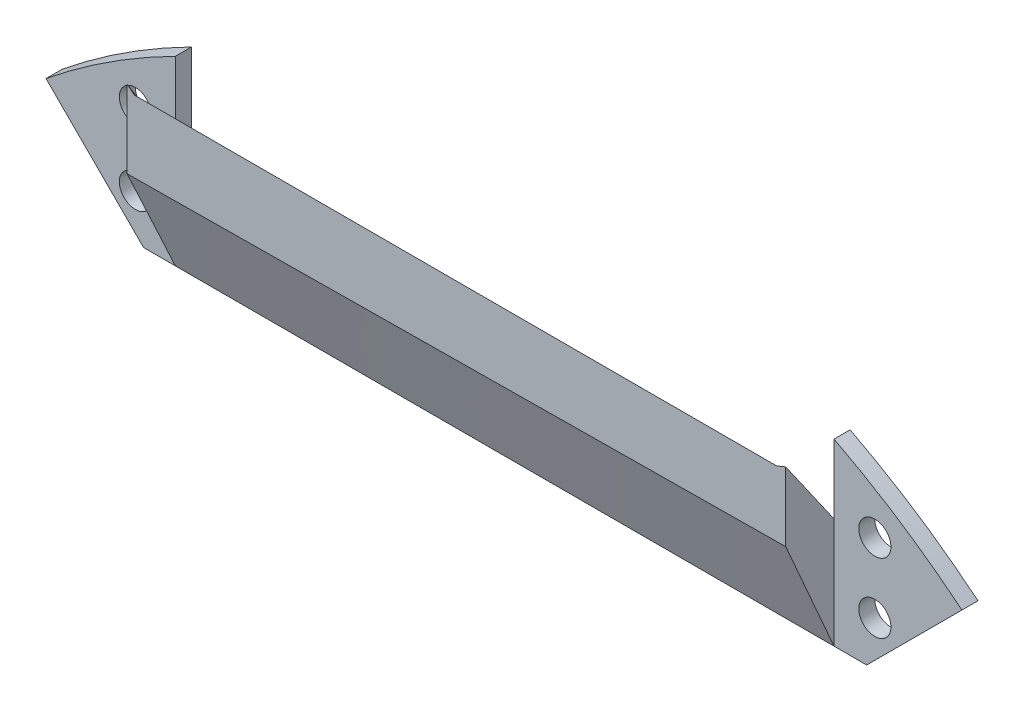
ISO-10303-21;
HEADER;
FILE_DESCRIPTION(('STEP AP214'),'2;1');
FILE_NAME('part.step','',(''),(''),'','','');
FILE_SCHEMA(('AUTOMOTIVE_DESIGN { 1 0 10303 214 1 1 1 1 }'));
ENDSEC;
DATA;
#1=APPLICATION_CONTEXT('core data for automotive mechanical design processes');
#2=APPLICATION_PROTOCOL_DEFINITION('international standard','automotive_design',2000,#1);
#3=PRODUCT_CONTEXT('',#1,'mechanical');
#4=PRODUCT('Part','Part','',(#3));
#5=PRODUCT_RELATED_PRODUCT_CATEGORY('part','',(#4));
#6=PRODUCT_DEFINITION_FORMATION('','',#4);
#7=PRODUCT_DEFINITION_CONTEXT('part definition',#1,'design');
#8=PRODUCT_DEFINITION('design','',#6,#7);
#9=PRODUCT_DEFINITION_SHAPE('','',#8);
#10=(LENGTH_UNIT() NAMED_UNIT(*) SI_UNIT(.MILLI.,.METRE.));
#11=(NAMED_UNIT(*) PLANE_ANGLE_UNIT() SI_UNIT($,.RADIAN.));
#12=(NAMED_UNIT(*) SI_UNIT($,.STERADIAN.) SOLID_ANGLE_UNIT());
#13=UNCERTAINTY_MEASURE_WITH_UNIT(LENGTH_MEASURE(1.E-05),#10,'distance_accuracy_value','');
#14=(GEOMETRIC_REPRESENTATION_CONTEXT(3) GLOBAL_UNCERTAINTY_ASSIGNED_CONTEXT((#13)) GLOBAL_UNIT_ASSIGNED_CONTEXT((#10,
#11,#12)) REPRESENTATION_CONTEXT('',''));
#15=CARTESIAN_POINT('',(0.,0.,0.));
#16=DIRECTION('',(0.,0.,1.));
#17=DIRECTION('',(1.,0.,0.));
#18=AXIS2_PLACEMENT_3D('',#15,#16,#17);
#19=CARTESIAN_POINT('',(312.744782742167,122.63354104966,2.));
#20=DIRECTION('',(0.,0.,1.));
#21=DIRECTION('',(1.,0.,0.));
#22=AXIS2_PLACEMENT_3D('',#19,#20,#21);
#23=PLANE('',#22);
#24=CARTESIAN_POINT('',(359.0430208,185.928,2.));
#25=DIRECTION('',(0.,0.,-1.));
#26=DIRECTION('',(-1.,0.,0.));
#27=AXIS2_PLACEMENT_3D('',#24,#25,#26);
#28=CIRCLE('',#27,1.99999599999999);
#29=CARTESIAN_POINT('',(357.0430248,185.928,2.));
#30=VERTEX_POINT('',#29);
#31=EDGE_CURVE('E354',#30,#30,#28,.T.);
#32=ORIENTED_EDGE('',*,*,#31,.T.);
#33=EDGE_LOOP('',(#32));
#34=FACE_BOUND('',#33,.T.);
#35=CARTESIAN_POINT('',(359.0430208,194.564,2.));
#36=DIRECTION('',(0.,0.,-1.));
#37=DIRECTION('',(-1.,0.,0.));
#38=AXIS2_PLACEMENT_3D('',#35,#36,#37);
#39=CIRCLE('',#38,1.99999599999999);
#40=CARTESIAN_POINT('',(357.0430248,194.564,2.));
#41=VERTEX_POINT('',#40);
#42=EDGE_CURVE('E213',#41,#41,#39,.T.);
#43=ORIENTED_EDGE('',*,*,#42,.T.);
#44=EDGE_LOOP('',(#43));
#45=FACE_BOUND('',#44,.T.);
#46=DIRECTION('',(0.,-1.,0.));
#47=VECTOR('',#46,1.);
#48=CARTESIAN_POINT('',(353.9630208,202.640144059614,2.));
#49=LINE('',#48,#47);
#50=CARTESIAN_POINT('',(353.9630208,202.640144059614,2.));
#51=VERTEX_POINT('',#50);
#52=CARTESIAN_POINT('',(353.9630208,194.056,2.));
#53=VERTEX_POINT('',#52);
#54=EDGE_CURVE('E270',#51,#53,#49,.T.);
#55=ORIENTED_EDGE('',*,*,#54,.T.);
#56=DIRECTION('',(0.,1.,0.));
#57=VECTOR('',#56,1.);
#58=CARTESIAN_POINT('',(353.9630208,180.34,2.));
#59=LINE('',#58,#57);
#60=CARTESIAN_POINT('',(353.9630208,180.34,2.));
#61=VERTEX_POINT('',#60);
#62=EDGE_CURVE('E127',#61,#53,#59,.T.);
#63=ORIENTED_EDGE('',*,*,#62,.F.);
#64=DIRECTION('',(1.,0.,0.));
#65=VECTOR('',#64,1.);
#66=CARTESIAN_POINT('',(268.1110208,180.34,2.));
#67=LINE('',#66,#65);
#68=CARTESIAN_POINT('',(358.0270208,180.34,2.));
#69=VERTEX_POINT('',#68);
#70=EDGE_CURVE('E179',#61,#69,#67,.T.);
#71=ORIENTED_EDGE('',*,*,#70,.T.);
#72=DIRECTION('',(0.707156854137584,0.707056704689402,0.));
#73=VECTOR('',#72,1.);
#74=CARTESIAN_POINT('',(369.869282259893,192.180584327099,2.));
#75=LINE('',#74,#73);
#76=CARTESIAN_POINT('',(369.869282259893,192.180584327099,2.));
#77=VERTEX_POINT('',#76);
#78=EDGE_CURVE('E75',#69,#77,#75,.T.);
#79=ORIENTED_EDGE('',*,*,#78,.T.);
#80=CARTESIAN_POINT('',(312.744782742167,122.63354104966,2.));
#81=DIRECTION('',(0.,0.,1.));
#82=DIRECTION('',(1.,0.,0.));
#83=AXIS2_PLACEMENT_3D('',#80,#81,#82);
#84=CIRCLE('',#83,89.9999981876925);
#85=EDGE_CURVE('E239',#77,#51,#84,.T.);
#86=ORIENTED_EDGE('',*,*,#85,.T.);
#87=EDGE_LOOP('',(#55,#63,#71,#79,#86));
#88=FACE_BOUND('',#87,.T.);
#89=ADVANCED_FACE('F55',(#34,#45,#88),#23,.T.);
#90=CARTESIAN_POINT('',(267.0950208,185.928,2.));
#91=DIRECTION('',(0.,0.,-1.));
#92=DIRECTION('',(-1.,0.,0.));
#93=AXIS2_PLACEMENT_3D('',#90,#91,#92);
#94=CIRCLE('',#93,1.99999599999999);
#95=CARTESIAN_POINT('',(265.0950248,185.928,2.));
#96=VERTEX_POINT('',#95);
#97=EDGE_CURVE('E346',#96,#96,#94,.T.);
#98=ORIENTED_EDGE('',*,*,#97,.T.);
#99=EDGE_LOOP('',(#98));
#100=FACE_BOUND('',#99,.T.);
#101=CARTESIAN_POINT('',(267.0950208,195.072,2.));
#102=DIRECTION('',(0.,0.,-1.));
#103=DIRECTION('',(-1.,0.,0.));
#104=AXIS2_PLACEMENT_3D('',#101,#102,#103);
#105=CIRCLE('',#104,1.99999600000005);
#106=CARTESIAN_POINT('',(265.0950248,195.072,2.));
#107=VERTEX_POINT('',#106);
#108=EDGE_CURVE('E338',#107,#107,#105,.T.);
#109=ORIENTED_EDGE('',*,*,#108,.T.);
#110=EDGE_LOOP('',(#109));
#111=FACE_BOUND('',#110,.T.);
#112=CARTESIAN_POINT('',(268.1110208,180.34,2.));
#113=VERTEX_POINT('',#112);
#114=CARTESIAN_POINT('',(272.0624988,180.34,2.));
#115=VERTEX_POINT('',#114);
#116=EDGE_CURVE('E172',#113,#115,#67,.T.);
#117=ORIENTED_EDGE('',*,*,#116,.T.);
#118=DIRECTION('',(0.,-1.,0.));
#119=VECTOR('',#118,1.);
#120=CARTESIAN_POINT('',(272.0624988,193.261996,2.));
#121=LINE('',#120,#119);
#122=CARTESIAN_POINT('',(272.0624988,193.261996,2.));
#123=VERTEX_POINT('',#122);
#124=EDGE_CURVE('E281',#123,#115,#121,.T.);
#125=ORIENTED_EDGE('',*,*,#124,.F.);
#126=DIRECTION('',(0.,1.,0.));
#127=VECTOR('',#126,1.);
#128=CARTESIAN_POINT('',(272.0624988,193.261996,2.));
#129=LINE('',#128,#127);
#130=CARTESIAN_POINT('',(272.0624988,202.913996,2.));
#131=VERTEX_POINT('',#130);
#132=EDGE_CURVE('E266',#123,#131,#129,.T.);
#133=ORIENTED_EDGE('',*,*,#132,.T.);
#134=CARTESIAN_POINT('',(312.744782742167,122.63354104966,2.));
#135=DIRECTION('',(0.,0.,1.));
#136=DIRECTION('',(1.,0.,0.));
#137=AXIS2_PLACEMENT_3D('',#134,#135,#136);
#138=CIRCLE('',#137,89.9999981876924);
#139=CARTESIAN_POINT('',(255.978033196525,192.472898290453,2.));
#140=VERTEX_POINT('',#139);
#141=EDGE_CURVE('E174',#131,#140,#138,.T.);
#142=ORIENTED_EDGE('',*,*,#141,.T.);
#143=DIRECTION('',(0.70710938375904,-0.707104178604476,0.));
#144=VECTOR('',#143,1.);
#145=CARTESIAN_POINT('',(255.978033196525,192.472898290453,2.));
#146=LINE('',#145,#144);
#147=EDGE_CURVE('E167',#140,#113,#146,.T.);
#148=ORIENTED_EDGE('',*,*,#147,.T.);
#149=EDGE_LOOP('',(#117,#125,#133,#142,#148));
#150=FACE_BOUND('',#149,.T.);
#151=ADVANCED_FACE('F169',(#100,#111,#150),#23,.T.);
#152=CARTESIAN_POINT('',(312.744782742167,122.63354104966,2.));
#153=DIRECTION('',(0.,0.,-1.));
#154=DIRECTION('',(-1.,0.,0.));
#155=AXIS2_PLACEMENT_3D('',#152,#153,#154);
#156=CYLINDRICAL_SURFACE('',#155,89.9999981876925);
#157=CARTESIAN_POINT('',(312.744782742167,122.63354104966,0.));
#158=DIRECTION('',(0.,0.,1.));
#159=DIRECTION('',(1.,0.,0.));
#160=AXIS2_PLACEMENT_3D('',#157,#158,#159);
#161=CIRCLE('',#160,89.9999981876925);
#162=CARTESIAN_POINT('',(369.869282259893,192.180584327099,0.));
#163=VERTEX_POINT('',#162);
#164=CARTESIAN_POINT('',(353.9630208,202.640144059614,0.));
#165=VERTEX_POINT('',#164);
#166=EDGE_CURVE('E208',#163,#165,#161,.T.);
#167=ORIENTED_EDGE('',*,*,#166,.T.);
#168=DIRECTION('',(0.,0.,-1.));
#169=VECTOR('',#168,1.);
#170=CARTESIAN_POINT('',(353.9630208,202.640144059614,2.));
#171=LINE('',#170,#169);
#172=EDGE_CURVE('E12',#51,#165,#171,.T.);
#173=ORIENTED_EDGE('',*,*,#172,.F.);
#174=ORIENTED_EDGE('',*,*,#85,.F.);
#175=DIRECTION('',(0.,0.,-1.));
#176=VECTOR('',#175,1.);
#177=CARTESIAN_POINT('',(369.869282259893,192.180584327099,2.));
#178=LINE('',#177,#176);
#179=EDGE_CURVE('E198',#77,#163,#178,.T.);
#180=ORIENTED_EDGE('',*,*,#179,.T.);
#181=EDGE_LOOP('',(#167,#173,#174,#180));
#182=FACE_BOUND('',#181,.T.);
#183=ADVANCED_FACE('F57',(#182),#156,.T.);
#184=CARTESIAN_POINT('',(353.9630208,202.640144059614,2.));
#185=DIRECTION('',(1.,0.,0.));
#186=DIRECTION('',(0.,1.,0.));
#187=AXIS2_PLACEMENT_3D('',#184,#185,#186);
#188=PLANE('',#187);
#189=DIRECTION('',(0.,-1.,0.));
#190=VECTOR('',#189,1.);
#191=CARTESIAN_POINT('',(353.9630208,202.640144059614,0.));
#192=LINE('',#191,#190);
#193=CARTESIAN_POINT('',(353.9630208,194.056,0.));
#194=VERTEX_POINT('',#193);
#195=EDGE_CURVE('E212',#165,#194,#192,.T.);
#196=ORIENTED_EDGE('',*,*,#195,.T.);
#197=DIRECTION('',(0.,0.,-1.));
#198=VECTOR('',#197,1.);
#199=CARTESIAN_POINT('',(353.9630208,194.056,2.));
#200=LINE('',#199,#198);
#201=EDGE_CURVE('E66',#53,#194,#200,.T.);
#202=ORIENTED_EDGE('',*,*,#201,.F.);
#203=ORIENTED_EDGE('',*,*,#54,.F.);
#204=ORIENTED_EDGE('',*,*,#172,.T.);
#205=EDGE_LOOP('',(#196,#202,#203,#204));
#206=FACE_BOUND('',#205,.T.);
#207=ADVANCED_FACE('F474',(#206),#188,.F.);
#208=CARTESIAN_POINT('',(353.9630208,194.056,2.));
#209=DIRECTION('',(0.799999999999999,-0.600000000000001,0.));
#210=DIRECTION('',(0.600000000000001,0.799999999999999,0.));
#211=AXIS2_PLACEMENT_3D('',#208,#209,#210);
#212=PLANE('',#211);
#213=DIRECTION('',(-0.600000000000001,-0.799999999999999,0.));
#214=VECTOR('',#213,1.);
#215=CARTESIAN_POINT('',(353.9630208,194.056,0.));
#216=LINE('',#215,#214);
#217=CARTESIAN_POINT('',(347.8670208,185.928,0.));
#218=VERTEX_POINT('',#217);
#219=EDGE_CURVE('E216',#194,#218,#216,.T.);
#220=ORIENTED_EDGE('',*,*,#219,.T.);
#221=DIRECTION('',(0.,0.,-1.));
#222=VECTOR('',#221,1.);
#223=CARTESIAN_POINT('',(347.8670208,185.928,2.));
#224=LINE('',#223,#222);
#225=CARTESIAN_POINT('',(347.8670208,185.928,2.00000000000001));
#226=VERTEX_POINT('',#225);
#227=EDGE_CURVE('E263',#226,#218,#224,.T.);
#228=ORIENTED_EDGE('',*,*,#227,.F.);
#229=DIRECTION('',(0.600000000000001,0.799999999999999,0.));
#230=VECTOR('',#229,1.);
#231=CARTESIAN_POINT('',(353.9630208,194.056,2.));
#232=LINE('',#231,#230);
#233=EDGE_CURVE('E274',#53,#226,#232,.F.);
#234=ORIENTED_EDGE('',*,*,#233,.F.);
#235=ORIENTED_EDGE('',*,*,#201,.T.);
#236=EDGE_LOOP('',(#220,#228,#234,#235));
#237=FACE_BOUND('',#236,.T.);
#238=ADVANCED_FACE('F478',(#237),#212,.F.);
#239=CARTESIAN_POINT('',(347.8670208,185.928,2.));
#240=DIRECTION('',(0.,-1.,0.));
#241=DIRECTION('',(0.,0.,-1.));
#242=AXIS2_PLACEMENT_3D('',#239,#240,#241);
#243=PLANE('',#242);
#244=DIRECTION('',(-1.,0.,0.));
#245=VECTOR('',#244,1.);
#246=CARTESIAN_POINT('',(347.8670208,185.928,0.));
#247=LINE('',#246,#245);
#248=CARTESIAN_POINT('',(277.7630208,185.928,0.));
#249=VERTEX_POINT('',#248);
#250=EDGE_CURVE('E219',#218,#249,#247,.T.);
#251=ORIENTED_EDGE('',*,*,#250,.T.);
#252=DIRECTION('',(0.,0.,-1.));
#253=VECTOR('',#252,1.);
#254=CARTESIAN_POINT('',(277.7630208,185.928,2.));
#255=LINE('',#254,#253);
#256=CARTESIAN_POINT('',(277.7630208,185.928,2.00000000000001));
#257=VERTEX_POINT('',#256);
#258=EDGE_CURVE('E256',#257,#249,#255,.T.);
#259=ORIENTED_EDGE('',*,*,#258,.F.);
#260=DIRECTION('',(1.,0.,0.));
#261=VECTOR('',#260,1.);
#262=CARTESIAN_POINT('',(0.,185.928,2.00000000000003));
#263=LINE('',#262,#261);
#264=EDGE_CURVE('E291',#226,#257,#263,.F.);
#265=ORIENTED_EDGE('',*,*,#264,.F.);
#266=ORIENTED_EDGE('',*,*,#227,.T.);
#267=EDGE_LOOP('',(#251,#259,#265,#266));
#268=FACE_BOUND('',#267,.T.);
#269=ADVANCED_FACE('F565',(#268),#243,.F.);
#270=CARTESIAN_POINT('',(277.7630208,185.928,2.));
#271=DIRECTION('',(-0.789545062308471,-0.613692589644288,0.));
#272=DIRECTION('',(0.613692589644288,-0.789545062308471,0.));
#273=AXIS2_PLACEMENT_3D('',#270,#271,#272);
#274=PLANE('',#273);
#275=DIRECTION('',(-0.613692589644288,0.789545062308471,0.));
#276=VECTOR('',#275,1.);
#277=CARTESIAN_POINT('',(277.7630208,185.928,0.));
#278=LINE('',#277,#276);
#279=CARTESIAN_POINT('',(272.0624988,193.261996,0.));
#280=VERTEX_POINT('',#279);
#281=EDGE_CURVE('E222',#249,#280,#278,.T.);
#282=ORIENTED_EDGE('',*,*,#281,.T.);
#283=DIRECTION('',(0.,0.,-1.));
#284=VECTOR('',#283,1.);
#285=CARTESIAN_POINT('',(272.0624988,193.261996,2.));
#286=LINE('',#285,#284);
#287=EDGE_CURVE('E250',#123,#280,#286,.T.);
#288=ORIENTED_EDGE('',*,*,#287,.F.);
#289=DIRECTION('',(0.613692589644288,-0.789545062308471,0.));
#290=VECTOR('',#289,1.);
#291=CARTESIAN_POINT('',(277.7630208,185.928,2.));
#292=LINE('',#291,#290);
#293=EDGE_CURVE('E269',#257,#123,#292,.F.);
#294=ORIENTED_EDGE('',*,*,#293,.F.);
#295=ORIENTED_EDGE('',*,*,#258,.T.);
#296=EDGE_LOOP('',(#282,#288,#294,#295));
#297=FACE_BOUND('',#296,.T.);
#298=ADVANCED_FACE('F457',(#297),#274,.F.);
#299=CARTESIAN_POINT('',(272.0624988,193.261996,2.));
#300=DIRECTION('',(-1.,0.,0.));
#301=DIRECTION('',(0.,0.,1.));
#302=AXIS2_PLACEMENT_3D('',#299,#300,#301);
#303=PLANE('',#302);
#304=DIRECTION('',(0.,1.,0.));
#305=VECTOR('',#304,1.);
#306=CARTESIAN_POINT('',(272.0624988,193.261996,0.));
#307=LINE('',#306,#305);
#308=CARTESIAN_POINT('',(272.0624988,202.913996,0.));
#309=VERTEX_POINT('',#308);
#310=EDGE_CURVE('E225',#280,#309,#307,.T.);
#311=ORIENTED_EDGE('',*,*,#310,.T.);
#312=DIRECTION('',(0.,0.,-1.));
#313=VECTOR('',#312,1.);
#314=CARTESIAN_POINT('',(272.0624988,202.913996,2.));
#315=LINE('',#314,#313);
#316=EDGE_CURVE('E247',#131,#309,#315,.T.);
#317=ORIENTED_EDGE('',*,*,#316,.F.);
#318=ORIENTED_EDGE('',*,*,#132,.F.);
#319=ORIENTED_EDGE('',*,*,#287,.T.);
#320=EDGE_LOOP('',(#311,#317,#318,#319));
#321=FACE_BOUND('',#320,.T.);
#322=ADVANCED_FACE('F459',(#321),#303,.F.);
#323=CARTESIAN_POINT('',(312.744782742167,122.63354104966,2.));
#324=DIRECTION('',(0.,0.,-1.));
#325=DIRECTION('',(-1.,0.,0.));
#326=AXIS2_PLACEMENT_3D('',#323,#324,#325);
#327=CYLINDRICAL_SURFACE('',#326,89.9999981876924);
#328=CARTESIAN_POINT('',(312.744782742167,122.63354104966,0.));
#329=DIRECTION('',(0.,0.,1.));
#330=DIRECTION('',(1.,0.,0.));
#331=AXIS2_PLACEMENT_3D('',#328,#329,#330);
#332=CIRCLE('',#331,89.9999981876924);
#333=CARTESIAN_POINT('',(255.978033196525,192.472898290453,0.));
#334=VERTEX_POINT('',#333);
#335=EDGE_CURVE('E228',#309,#334,#332,.T.);
#336=ORIENTED_EDGE('',*,*,#335,.T.);
#337=DIRECTION('',(0.,0.,-1.));
#338=VECTOR('',#337,1.);
#339=CARTESIAN_POINT('',(255.978033196525,192.472898290453,2.));
#340=LINE('',#339,#338);
#341=EDGE_CURVE('E189',#140,#334,#340,.T.);
#342=ORIENTED_EDGE('',*,*,#341,.F.);
#343=ORIENTED_EDGE('',*,*,#141,.F.);
#344=ORIENTED_EDGE('',*,*,#316,.T.);
#345=EDGE_LOOP('',(#336,#342,#343,#344));
#346=FACE_BOUND('',#345,.T.);
#347=ADVANCED_FACE('F460',(#346),#327,.T.);
#348=CARTESIAN_POINT('',(255.978033196525,192.472898290453,2.));
#349=DIRECTION('',(0.707104178604476,0.70710938375904,0.));
#350=DIRECTION('',(-0.70710938375904,0.707104178604476,0.));
#351=AXIS2_PLACEMENT_3D('',#348,#349,#350);
#352=PLANE('',#351);
#353=DIRECTION('',(0.70710938375904,-0.707104178604476,0.));
#354=VECTOR('',#353,1.);
#355=CARTESIAN_POINT('',(255.978033196525,192.472898290453,0.));
#356=LINE('',#355,#354);
#357=CARTESIAN_POINT('',(268.1110208,180.34,0.));
#358=VERTEX_POINT('',#357);
#359=EDGE_CURVE('E185',#334,#358,#356,.T.);
#360=ORIENTED_EDGE('',*,*,#359,.T.);
#361=DIRECTION('',(0.,0.,-1.));
#362=VECTOR('',#361,1.);
#363=CARTESIAN_POINT('',(268.1110208,180.34,2.));
#364=LINE('',#363,#362);
#365=EDGE_CURVE('E182',#113,#358,#364,.T.);
#366=ORIENTED_EDGE('',*,*,#365,.F.);
#367=ORIENTED_EDGE('',*,*,#147,.F.);
#368=ORIENTED_EDGE('',*,*,#341,.T.);
#369=EDGE_LOOP('',(#360,#366,#367,#368));
#370=FACE_BOUND('',#369,.T.);
#371=ADVANCED_FACE('F183',(#370),#352,.F.);
#372=CARTESIAN_POINT('',(268.1110208,180.34,2.));
#373=DIRECTION('',(0.,1.,0.));
#374=DIRECTION('',(0.,0.,1.));
#375=AXIS2_PLACEMENT_3D('',#372,#373,#374);
#376=PLANE('',#375);
#377=DIRECTION('',(1.,0.,0.));
#378=VECTOR('',#377,1.);
#379=CARTESIAN_POINT('',(268.1110208,180.34,0.));
#380=LINE('',#379,#378);
#381=CARTESIAN_POINT('',(358.0270208,180.34,0.));
#382=VERTEX_POINT('',#381);
#383=EDGE_CURVE('E233',#358,#382,#380,.T.);
#384=ORIENTED_EDGE('',*,*,#383,.T.);
#385=DIRECTION('',(0.,0.,-1.));
#386=VECTOR('',#385,1.);
#387=CARTESIAN_POINT('',(358.0270208,180.34,2.));
#388=LINE('',#387,#386);
#389=EDGE_CURVE('E190',#69,#382,#388,.T.);
#390=ORIENTED_EDGE('',*,*,#389,.F.);
#391=ORIENTED_EDGE('',*,*,#70,.F.);
#392=DIRECTION('',(1.,0.,0.));
#393=VECTOR('',#392,1.);
#394=CARTESIAN_POINT('',(272.0624988,180.34,2.));
#395=LINE('',#394,#393);
#396=EDGE_CURVE('E137',#115,#61,#395,.T.);
#397=ORIENTED_EDGE('',*,*,#396,.F.);
#398=ORIENTED_EDGE('',*,*,#116,.F.);
#399=ORIENTED_EDGE('',*,*,#365,.T.);
#400=EDGE_LOOP('',(#384,#390,#391,#397,#398,#399));
#401=FACE_BOUND('',#400,.T.);
#402=ADVANCED_FACE('F192',(#401),#376,.F.);
#403=CARTESIAN_POINT('',(369.869282259893,192.180584327099,2.));
#404=DIRECTION('',(-0.707056704689402,0.707156854137584,0.));
#405=DIRECTION('',(-0.707156854137584,-0.707056704689402,0.));
#406=AXIS2_PLACEMENT_3D('',#403,#404,#405);
#407=PLANE('',#406);
#408=DIRECTION('',(0.707156854137584,0.707056704689402,0.));
#409=VECTOR('',#408,1.);
#410=CARTESIAN_POINT('',(369.869282259893,192.180584327099,0.));
#411=LINE('',#410,#409);
#412=EDGE_CURVE('E236',#382,#163,#411,.T.);
#413=ORIENTED_EDGE('',*,*,#412,.T.);
#414=ORIENTED_EDGE('',*,*,#179,.F.);
#415=ORIENTED_EDGE('',*,*,#78,.F.);
#416=ORIENTED_EDGE('',*,*,#389,.T.);
#417=EDGE_LOOP('',(#413,#414,#415,#416));
#418=FACE_BOUND('',#417,.T.);
#419=ADVANCED_FACE('F467',(#418),#407,.F.);
#420=CARTESIAN_POINT('',(312.744782742167,122.63354104966,0.));
#421=DIRECTION('',(0.,0.,1.));
#422=DIRECTION('',(1.,0.,0.));
#423=AXIS2_PLACEMENT_3D('',#420,#421,#422);
#424=PLANE('',#423);
#425=CARTESIAN_POINT('',(267.0950208,195.072,0.));
#426=DIRECTION('',(0.,0.,-1.));
#427=DIRECTION('',(-1.,0.,0.));
#428=AXIS2_PLACEMENT_3D('',#425,#426,#427);
#429=CIRCLE('',#428,1.99999600000005);
#430=CARTESIAN_POINT('',(265.0950248,195.072,0.));
#431=VERTEX_POINT('',#430);
#432=EDGE_CURVE('E342',#431,#431,#429,.T.);
#433=ORIENTED_EDGE('',*,*,#432,.F.);
#434=EDGE_LOOP('',(#433));
#435=FACE_BOUND('',#434,.T.);
#436=CARTESIAN_POINT('',(267.0950208,185.928,0.));
#437=DIRECTION('',(0.,0.,-1.));
#438=DIRECTION('',(-1.,0.,0.));
#439=AXIS2_PLACEMENT_3D('',#436,#437,#438);
#440=CIRCLE('',#439,1.99999599999999);
#441=CARTESIAN_POINT('',(265.0950248,185.928,0.));
#442=VERTEX_POINT('',#441);
#443=EDGE_CURVE('E350',#442,#442,#440,.T.);
#444=ORIENTED_EDGE('',*,*,#443,.F.);
#445=EDGE_LOOP('',(#444));
#446=FACE_BOUND('',#445,.T.);
#447=CARTESIAN_POINT('',(359.0430208,185.928,0.));
#448=DIRECTION('',(0.,0.,-1.));
#449=DIRECTION('',(-1.,0.,0.));
#450=AXIS2_PLACEMENT_3D('',#447,#448,#449);
#451=CIRCLE('',#450,1.99999599999999);
#452=CARTESIAN_POINT('',(357.0430248,185.928,0.));
#453=VERTEX_POINT('',#452);
#454=EDGE_CURVE('E358',#453,#453,#451,.T.);
#455=ORIENTED_EDGE('',*,*,#454,.F.);
#456=EDGE_LOOP('',(#455));
#457=FACE_BOUND('',#456,.T.);
#458=CARTESIAN_POINT('',(359.0430208,194.564,0.));
#459=DIRECTION('',(0.,0.,-1.));
#460=DIRECTION('',(-1.,0.,0.));
#461=AXIS2_PLACEMENT_3D('',#458,#459,#460);
#462=CIRCLE('',#461,1.99999599999999);
#463=CARTESIAN_POINT('',(357.0430248,194.564,0.));
#464=VERTEX_POINT('',#463);
#465=EDGE_CURVE('E362',#464,#464,#462,.T.);
#466=ORIENTED_EDGE('',*,*,#465,.F.);
#467=EDGE_LOOP('',(#466));
#468=FACE_BOUND('',#467,.T.);
#469=ORIENTED_EDGE('',*,*,#166,.F.);
#470=ORIENTED_EDGE('',*,*,#412,.F.);
#471=ORIENTED_EDGE('',*,*,#383,.F.);
#472=ORIENTED_EDGE('',*,*,#359,.F.);
#473=ORIENTED_EDGE('',*,*,#335,.F.);
#474=ORIENTED_EDGE('',*,*,#310,.F.);
#475=ORIENTED_EDGE('',*,*,#281,.F.);
#476=ORIENTED_EDGE('',*,*,#250,.F.);
#477=ORIENTED_EDGE('',*,*,#219,.F.);
#478=ORIENTED_EDGE('',*,*,#195,.F.);
#479=EDGE_LOOP('',(#469,#470,#471,#472,#473,#474,#475,#476,#477,#478));
#480=FACE_BOUND('',#479,.T.);
#481=ADVANCED_FACE('F463',(#435,#446,#457,#468,#480),#424,.F.);
#482=CARTESIAN_POINT('',(359.0430208,194.564,2.));
#483=DIRECTION('',(0.,0.,-1.));
#484=DIRECTION('',(-1.,0.,0.));
#485=AXIS2_PLACEMENT_3D('',#482,#483,#484);
#486=CYLINDRICAL_SURFACE('',#485,1.99999599999999);
#487=ORIENTED_EDGE('',*,*,#42,.F.);
#488=EDGE_LOOP('',(#487));
#489=FACE_BOUND('',#488,.T.);
#490=ORIENTED_EDGE('',*,*,#465,.T.);
#491=EDGE_LOOP('',(#490));
#492=FACE_BOUND('',#491,.T.);
#493=ADVANCED_FACE('F548',(#489,#492),#486,.F.);
#494=CARTESIAN_POINT('',(359.0430208,185.928,2.));
#495=DIRECTION('',(0.,0.,-1.));
#496=DIRECTION('',(-1.,0.,0.));
#497=AXIS2_PLACEMENT_3D('',#494,#495,#496);
#498=CYLINDRICAL_SURFACE('',#497,1.99999599999999);
#499=ORIENTED_EDGE('',*,*,#31,.F.);
#500=EDGE_LOOP('',(#499));
#501=FACE_BOUND('',#500,.T.);
#502=ORIENTED_EDGE('',*,*,#454,.T.);
#503=EDGE_LOOP('',(#502));
#504=FACE_BOUND('',#503,.T.);
#505=ADVANCED_FACE('F395',(#501,#504),#498,.F.);
#506=CARTESIAN_POINT('',(267.0950208,185.928,2.));
#507=DIRECTION('',(0.,0.,-1.));
#508=DIRECTION('',(-1.,0.,0.));
#509=AXIS2_PLACEMENT_3D('',#506,#507,#508);
#510=CYLINDRICAL_SURFACE('',#509,1.99999599999999);
#511=ORIENTED_EDGE('',*,*,#97,.F.);
#512=EDGE_LOOP('',(#511));
#513=FACE_BOUND('',#512,.T.);
#514=ORIENTED_EDGE('',*,*,#443,.T.);
#515=EDGE_LOOP('',(#514));
#516=FACE_BOUND('',#515,.T.);
#517=ADVANCED_FACE('F700',(#513,#516),#510,.F.);
#518=CARTESIAN_POINT('',(267.0950208,195.072,2.));
#519=DIRECTION('',(0.,0.,-1.));
#520=DIRECTION('',(-1.,0.,0.));
#521=AXIS2_PLACEMENT_3D('',#518,#519,#520);
#522=CYLINDRICAL_SURFACE('',#521,1.99999600000005);
#523=ORIENTED_EDGE('',*,*,#108,.F.);
#524=EDGE_LOOP('',(#523));
#525=FACE_BOUND('',#524,.T.);
#526=ORIENTED_EDGE('',*,*,#432,.T.);
#527=EDGE_LOOP('',(#526));
#528=FACE_BOUND('',#527,.T.);
#529=ADVANCED_FACE('F388',(#525,#528),#522,.F.);
#530=CARTESIAN_POINT('',(0.,0.,8.));
#531=DIRECTION('',(0.,0.,1.));
#532=DIRECTION('',(1.,0.,0.));
#533=AXIS2_PLACEMENT_3D('',#530,#531,#532);
#534=PLANE('',#533);
#535=DIRECTION('',(-0.778918093395881,0.627125668252007,0.));
#536=VECTOR('',#535,1.);
#537=CARTESIAN_POINT('',(272.0624988,202.913996,8.));
#538=LINE('',#537,#536);
#539=CARTESIAN_POINT('',(272.968388734981,202.184642251956,8.));
#540=VERTEX_POINT('',#539);
#541=CARTESIAN_POINT('',(272.0624988,202.913996,8.));
#542=VERTEX_POINT('',#541);
#543=EDGE_CURVE('E319',#540,#542,#538,.T.);
#544=ORIENTED_EDGE('',*,*,#543,.T.);
#545=DIRECTION('',(0.,-1.,0.));
#546=VECTOR('',#545,1.);
#547=CARTESIAN_POINT('',(272.0624988,202.913996,8.));
#548=LINE('',#547,#546);
#549=CARTESIAN_POINT('',(272.0624988,193.261996,8.));
#550=VERTEX_POINT('',#549);
#551=EDGE_CURVE('E335',#542,#550,#548,.T.);
#552=ORIENTED_EDGE('',*,*,#551,.T.);
#553=DIRECTION('',(0.99995300935212,0.00969428118220794,0.));
#554=VECTOR('',#553,1.);
#555=CARTESIAN_POINT('',(272.0624988,193.261996,8.));
#556=LINE('',#555,#554);
#557=CARTESIAN_POINT('',(353.9630208,194.056,8.));
#558=VERTEX_POINT('',#557);
#559=EDGE_CURVE('E332',#550,#558,#556,.T.);
#560=ORIENTED_EDGE('',*,*,#559,.T.);
#561=DIRECTION('',(0.,1.,0.));
#562=VECTOR('',#561,1.);
#563=CARTESIAN_POINT('',(353.9630208,194.056,8.));
#564=LINE('',#563,#562);
#565=CARTESIAN_POINT('',(353.9630208,202.640144059614,8.));
#566=VERTEX_POINT('',#565);
#567=EDGE_CURVE('E329',#558,#566,#564,.T.);
#568=ORIENTED_EDGE('',*,*,#567,.T.);
#569=DIRECTION('',(-0.93022884271668,-0.36697997244807,0.));
#570=VECTOR('',#569,1.);
#571=CARTESIAN_POINT('',(352.808404877592,202.184642251956,8.));
#572=LINE('',#571,#570);
#573=CARTESIAN_POINT('',(352.808404877592,202.184642251956,8.));
#574=VERTEX_POINT('',#573);
#575=EDGE_CURVE('E326',#566,#574,#572,.T.);
#576=ORIENTED_EDGE('',*,*,#575,.T.);
#577=DIRECTION('',(-1.,0.,0.));
#578=VECTOR('',#577,1.);
#579=CARTESIAN_POINT('',(272.968388734981,202.184642251956,8.));
#580=LINE('',#579,#578);
#581=EDGE_CURVE('E323',#574,#540,#580,.T.);
#582=ORIENTED_EDGE('',*,*,#581,.T.);
#583=EDGE_LOOP('',(#544,#552,#560,#568,#576,#582));
#584=FACE_BOUND('',#583,.T.);
#585=ADVANCED_FACE('F377',(#584),#534,.T.);
#586=CARTESIAN_POINT('',(277.7630208,185.928,2.));
#587=CARTESIAN_POINT('',(272.968388734981,202.184642251956,8.));
#588=CARTESIAN_POINT('',(276.8129338,187.150332666667,2.));
#589=CARTESIAN_POINT('',(272.81740707915,202.306201209963,8.));
#590=CARTESIAN_POINT('',(275.8628468,188.372665333333,2.));
#591=CARTESIAN_POINT('',(272.66642542332,202.427760167971,8.));
#592=CARTESIAN_POINT('',(273.9626728,190.817330666667,2.));
#593=CARTESIAN_POINT('',(272.36446211166,202.670878083985,8.));
#594=CARTESIAN_POINT('',(273.0125858,192.039663333333,2.));
#595=CARTESIAN_POINT('',(272.21348045583,202.792437041993,8.));
#596=CARTESIAN_POINT('',(272.0624988,193.261996,2.));
#597=CARTESIAN_POINT('',(272.0624988,202.913996,8.));
#598=B_SPLINE_SURFACE_WITH_KNOTS('',3,1,((#586,#587),(#588,#589),(#590,#591),(#592,#593),(#594,
#595),(#596,#597)),.UNSPECIFIED.,.F.,.F.,.F.,(4,2,4),(2,2),(0.,0.5,1.),(0.,1.),.UNSPECIFIED.);
#599=DIRECTION('',(0.,0.849281060195438,0.527940982301349));
#600=VECTOR('',#599,1.);
#601=CARTESIAN_POINT('',(272.0624988,198.087996,5.));
#602=LINE('',#601,#600);
#603=EDGE_CURVE('E302',#123,#542,#602,.T.);
#604=DIRECTION('',(0.266670304518102,-0.904170263949835,-0.333711076347653));
#605=VECTOR('',#604,1.);
#606=CARTESIAN_POINT('',(275.36570476749,194.056321125978,5.));
#607=LINE('',#606,#605);
#608=EDGE_CURVE('E288',#540,#257,#607,.T.);
#609=ORIENTED_EDGE('',*,*,#293,.T.);
#610=ORIENTED_EDGE('',*,*,#603,.T.);
#611=ORIENTED_EDGE('',*,*,#543,.F.);
#612=ORIENTED_EDGE('',*,*,#608,.T.);
#613=EDGE_LOOP('',(#609,#610,#611,#612));
#614=FACE_BOUND('',#613,.T.);
#615=ADVANCED_FACE('F387',(#614),#598,.T.);
#616=CARTESIAN_POINT('',(272.0624988,0.,0.));
#617=DIRECTION('',(1.,0.,0.));
#618=DIRECTION('',(0.,0.,-1.));
#619=AXIS2_PLACEMENT_3D('',#616,#617,#618);
#620=PLANE('',#619);
#621=DIRECTION('',(0.,0.906995512891886,0.421140284933636));
#622=VECTOR('',#621,1.);
#623=CARTESIAN_POINT('',(272.0624988,180.34,2.));
#624=LINE('',#623,#622);
#625=EDGE_CURVE('E305',#115,#550,#624,.T.);
#626=ORIENTED_EDGE('',*,*,#625,.T.);
#627=ORIENTED_EDGE('',*,*,#551,.F.);
#628=ORIENTED_EDGE('',*,*,#603,.F.);
#629=ORIENTED_EDGE('',*,*,#124,.T.);
#630=EDGE_LOOP('',(#626,#627,#628,#629));
#631=FACE_BOUND('',#630,.T.);
#632=ADVANCED_FACE('F454',(#631),#620,.F.);
#633=CARTESIAN_POINT('',(0.,21.6410102039043,-58.6350268093009));
#634=DIRECTION('',(0.,-0.346249529004539,0.938142453822517));
#635=DIRECTION('',(0.,-0.938142453822518,-0.346249529004539));
#636=AXIS2_PLACEMENT_3D('',#633,#634,#635);
#637=PLANE('',#636);
#638=ORIENTED_EDGE('',*,*,#608,.F.);
#639=ORIENTED_EDGE('',*,*,#581,.F.);
#640=DIRECTION('',(0.274227084846293,0.902178730521796,0.332976041376529));
#641=VECTOR('',#640,1.);
#642=CARTESIAN_POINT('',(350.337712838796,194.056321125978,5.));
#643=LINE('',#642,#641);
#644=EDGE_CURVE('E315',#226,#574,#643,.T.);
#645=ORIENTED_EDGE('',*,*,#644,.F.);
#646=ORIENTED_EDGE('',*,*,#264,.T.);
#647=EDGE_LOOP('',(#638,#639,#645,#646));
#648=FACE_BOUND('',#647,.T.);
#649=ADVANCED_FACE('F486',(#648),#637,.F.);
#650=CARTESIAN_POINT('',(272.0624988,180.34,2.));
#651=CARTESIAN_POINT('',(272.0624988,193.261996,8.));
#652=CARTESIAN_POINT('',(285.7125858,180.34,2.));
#653=CARTESIAN_POINT('',(285.7125858,193.39433,8.));
#654=CARTESIAN_POINT('',(299.3626728,180.34,2.));
#655=CARTESIAN_POINT('',(299.3626728,193.526664,8.));
#656=CARTESIAN_POINT('',(326.6628468,180.34,2.));
#657=CARTESIAN_POINT('',(326.6628468,193.791332,8.));
#658=CARTESIAN_POINT('',(340.3129338,180.34,2.));
#659=CARTESIAN_POINT('',(340.3129338,193.923666,8.));
#660=CARTESIAN_POINT('',(353.9630208,180.34,2.));
#661=CARTESIAN_POINT('',(353.9630208,194.056,8.));
#662=B_SPLINE_SURFACE_WITH_KNOTS('',3,1,((#650,#651),(#652,#653),(#654,#655),(#656,#657),(#658,
#659),(#660,#661)),.UNSPECIFIED.,.F.,.F.,.F.,(4,2,4),(2,2),(0.,0.5,1.),(0.,1.),.UNSPECIFIED.);
#663=DIRECTION('',(0.,0.916175730248675,0.400776784885685));
#664=VECTOR('',#663,1.);
#665=CARTESIAN_POINT('',(353.9630208,187.198,5.));
#666=LINE('',#665,#664);
#667=EDGE_CURVE('E309',#61,#558,#666,.T.);
#668=ORIENTED_EDGE('',*,*,#396,.T.);
#669=ORIENTED_EDGE('',*,*,#667,.T.);
#670=ORIENTED_EDGE('',*,*,#559,.F.);
#671=ORIENTED_EDGE('',*,*,#625,.F.);
#672=EDGE_LOOP('',(#668,#669,#670,#671));
#673=FACE_BOUND('',#672,.T.);
#674=ADVANCED_FACE('F451',(#673),#662,.T.);
#675=CARTESIAN_POINT('',(353.963020799999,-2.28897542276152E-12,0.));
#676=DIRECTION('',(-1.,0.,0.));
#677=DIRECTION('',(0.,-1.,0.));
#678=AXIS2_PLACEMENT_3D('',#675,#676,#677);
#679=PLANE('',#678);
#680=DIRECTION('',(0.,0.819630989698999,0.572891822881981));
#681=VECTOR('',#680,1.);
#682=CARTESIAN_POINT('',(353.9630208,194.056,2.));
#683=LINE('',#682,#681);
#684=EDGE_CURVE('E312',#53,#566,#683,.T.);
#685=ORIENTED_EDGE('',*,*,#684,.T.);
#686=ORIENTED_EDGE('',*,*,#567,.F.);
#687=ORIENTED_EDGE('',*,*,#667,.F.);
#688=ORIENTED_EDGE('',*,*,#62,.T.);
#689=EDGE_LOOP('',(#685,#686,#687,#688));
#690=FACE_BOUND('',#689,.T.);
#691=ADVANCED_FACE('F511',(#690),#679,.F.);
#692=CARTESIAN_POINT('',(353.9630208,194.056,2.));
#693=CARTESIAN_POINT('',(353.9630208,202.640144059614,8.));
#694=CARTESIAN_POINT('',(352.9470208,192.701333333333,2.));
#695=CARTESIAN_POINT('',(353.770584812932,202.564227091671,8.));
#696=CARTESIAN_POINT('',(351.9310208,191.346666666667,2.));
#697=CARTESIAN_POINT('',(353.578148825864,202.488310123728,8.));
#698=CARTESIAN_POINT('',(349.8990208,188.637333333334,2.));
#699=CARTESIAN_POINT('',(353.193276851728,202.336476187842,8.));
#700=CARTESIAN_POINT('',(348.8830208,187.282666666667,2.));
#701=CARTESIAN_POINT('',(353.00084086466,202.260559219899,8.));
#702=CARTESIAN_POINT('',(347.8670208,185.928,2.));
#703=CARTESIAN_POINT('',(352.808404877592,202.184642251956,8.));
#704=B_SPLINE_SURFACE_WITH_KNOTS('',3,1,((#692,#693),(#694,#695),(#696,#697),(#698,#699),(#700,
#701),(#702,#703)),.UNSPECIFIED.,.F.,.F.,.F.,(4,2,4),(2,2),(0.,0.5,1.),(0.,1.),.UNSPECIFIED.);
#705=ORIENTED_EDGE('',*,*,#233,.T.);
#706=ORIENTED_EDGE('',*,*,#644,.T.);
#707=ORIENTED_EDGE('',*,*,#575,.F.);
#708=ORIENTED_EDGE('',*,*,#684,.F.);
#709=EDGE_LOOP('',(#705,#706,#707,#708));
#710=FACE_BOUND('',#709,.T.);
#711=ADVANCED_FACE('F390',(#710),#704,.T.);
#712=CLOSED_SHELL('',(#89,#151,#183,#207,#238,#269,#298,#322,#347,#371,#402,#419,#481,#493,#505,
#517,#529,#585,#615,#632,#649,#674,#691,#711));
#713=MANIFOLD_SOLID_BREP('B2',#712);
#714=ADVANCED_BREP_SHAPE_REPRESENTATION('',(#18,#713),#14);
#715=SHAPE_DEFINITION_REPRESENTATION(#9,#714);
ENDSEC;
END-ISO-10303-21;
